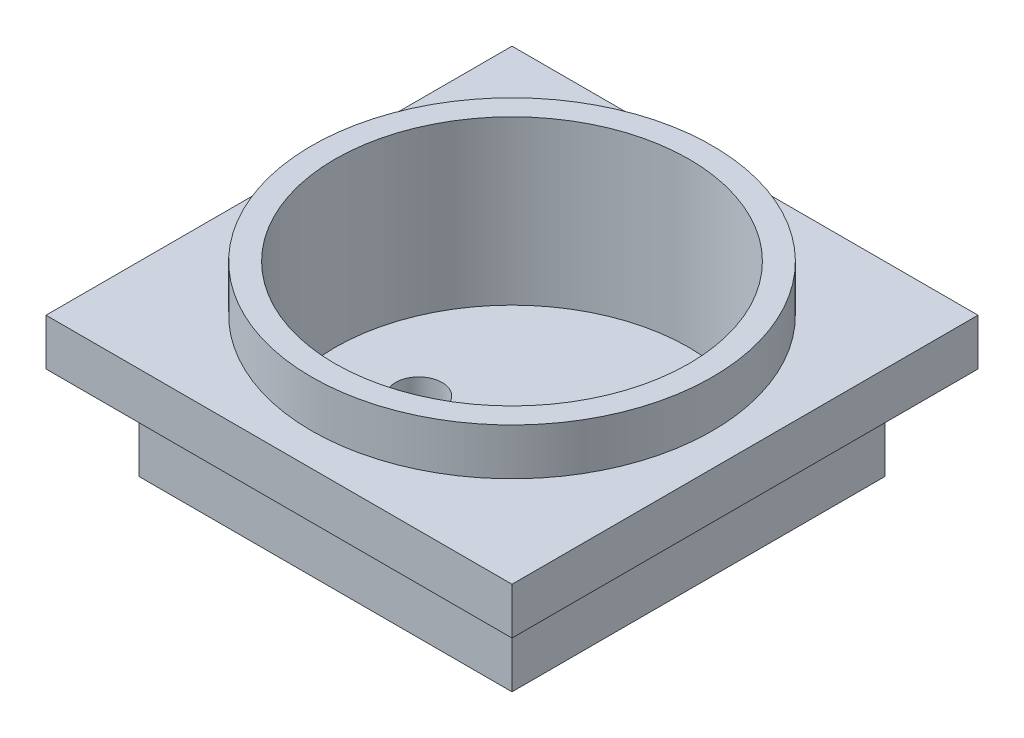
ISO-10303-21;
HEADER;
FILE_DESCRIPTION(('STEP AP214'),'2;1');
FILE_NAME('part.step','',(''),(''),'','','');
FILE_SCHEMA(('AUTOMOTIVE_DESIGN { 1 0 10303 214 1 1 1 1 }'));
ENDSEC;
DATA;
#1=APPLICATION_CONTEXT('core data for automotive mechanical design processes');
#2=APPLICATION_PROTOCOL_DEFINITION('international standard','automotive_design',2000,#1);
#3=PRODUCT_CONTEXT('',#1,'mechanical');
#4=PRODUCT('Part','Part','',(#3));
#5=PRODUCT_RELATED_PRODUCT_CATEGORY('part','',(#4));
#6=PRODUCT_DEFINITION_FORMATION('','',#4);
#7=PRODUCT_DEFINITION_CONTEXT('part definition',#1,'design');
#8=PRODUCT_DEFINITION('design','',#6,#7);
#9=PRODUCT_DEFINITION_SHAPE('','',#8);
#10=(LENGTH_UNIT() NAMED_UNIT(*) SI_UNIT(.MILLI.,.METRE.));
#11=(NAMED_UNIT(*) PLANE_ANGLE_UNIT() SI_UNIT($,.RADIAN.));
#12=(NAMED_UNIT(*) SI_UNIT($,.STERADIAN.) SOLID_ANGLE_UNIT());
#13=UNCERTAINTY_MEASURE_WITH_UNIT(LENGTH_MEASURE(1.E-05),#10,'distance_accuracy_value','');
#14=(GEOMETRIC_REPRESENTATION_CONTEXT(3) GLOBAL_UNCERTAINTY_ASSIGNED_CONTEXT((#13)) GLOBAL_UNIT_ASSIGNED_CONTEXT((#10,
#11,#12)) REPRESENTATION_CONTEXT('',''));
#15=CARTESIAN_POINT('',(0.,0.,0.));
#16=DIRECTION('',(0.,0.,1.));
#17=DIRECTION('',(1.,0.,0.));
#18=AXIS2_PLACEMENT_3D('',#15,#16,#17);
#19=CARTESIAN_POINT('',(0.,0.,0.));
#20=DIRECTION('',(0.,1.,0.));
#21=DIRECTION('',(0.,0.,1.));
#22=AXIS2_PLACEMENT_3D('',#19,#20,#21);
#23=PLANE('',#22);
#24=DIRECTION('',(0.,0.,-1.));
#25=VECTOR('',#24,1.);
#26=CARTESIAN_POINT('',(25.,0.,-25.));
#27=LINE('',#26,#25);
#28=CARTESIAN_POINT('',(25.,0.,25.));
#29=VERTEX_POINT('',#28);
#30=CARTESIAN_POINT('',(25.,0.,-25.));
#31=VERTEX_POINT('',#30);
#32=EDGE_CURVE('E146',#29,#31,#27,.T.);
#33=ORIENTED_EDGE('',*,*,#32,.F.);
#34=DIRECTION('',(1.,0.,0.));
#35=VECTOR('',#34,1.);
#36=CARTESIAN_POINT('',(-25.,0.,25.));
#37=LINE('',#36,#35);
#38=CARTESIAN_POINT('',(-25.,0.,25.));
#39=VERTEX_POINT('',#38);
#40=EDGE_CURVE('E157',#39,#29,#37,.T.);
#41=ORIENTED_EDGE('',*,*,#40,.F.);
#42=DIRECTION('',(0.,0.,1.));
#43=VECTOR('',#42,1.);
#44=CARTESIAN_POINT('',(-25.,0.,-25.));
#45=LINE('',#44,#43);
#46=CARTESIAN_POINT('',(-25.,0.,-25.));
#47=VERTEX_POINT('',#46);
#48=EDGE_CURVE('E170',#47,#39,#45,.T.);
#49=ORIENTED_EDGE('',*,*,#48,.F.);
#50=DIRECTION('',(-1.,0.,0.));
#51=VECTOR('',#50,1.);
#52=CARTESIAN_POINT('',(-25.,0.,-25.));
#53=LINE('',#52,#51);
#54=EDGE_CURVE('E168',#31,#47,#53,.T.);
#55=ORIENTED_EDGE('',*,*,#54,.F.);
#56=EDGE_LOOP('',(#33,#41,#49,#55));
#57=FACE_BOUND('',#56,.T.);
#58=DIRECTION('',(0.,0.,-1.));
#59=VECTOR('',#58,1.);
#60=CARTESIAN_POINT('',(-20.,0.,-20.));
#61=LINE('',#60,#59);
#62=CARTESIAN_POINT('',(-20.,0.,20.));
#63=VERTEX_POINT('',#62);
#64=CARTESIAN_POINT('',(-20.,0.,-20.));
#65=VERTEX_POINT('',#64);
#66=EDGE_CURVE('E58',#63,#65,#61,.T.);
#67=ORIENTED_EDGE('',*,*,#66,.F.);
#68=DIRECTION('',(-1.,0.,0.));
#69=VECTOR('',#68,1.);
#70=CARTESIAN_POINT('',(20.,0.,20.));
#71=LINE('',#70,#69);
#72=CARTESIAN_POINT('',(20.,0.,20.));
#73=VERTEX_POINT('',#72);
#74=EDGE_CURVE('E65',#73,#63,#71,.T.);
#75=ORIENTED_EDGE('',*,*,#74,.F.);
#76=DIRECTION('',(0.,0.,1.));
#77=VECTOR('',#76,1.);
#78=CARTESIAN_POINT('',(20.,0.,-20.));
#79=LINE('',#78,#77);
#80=CARTESIAN_POINT('',(20.,0.,-20.));
#81=VERTEX_POINT('',#80);
#82=EDGE_CURVE('E387',#81,#73,#79,.T.);
#83=ORIENTED_EDGE('',*,*,#82,.F.);
#84=DIRECTION('',(1.,0.,0.));
#85=VECTOR('',#84,1.);
#86=CARTESIAN_POINT('',(20.,0.,-20.));
#87=LINE('',#86,#85);
#88=EDGE_CURVE('E384',#65,#81,#87,.T.);
#89=ORIENTED_EDGE('',*,*,#88,.F.);
#90=EDGE_LOOP('',(#67,#75,#83,#89));
#91=FACE_BOUND('',#90,.T.);
#92=ADVANCED_FACE('F38',(#57,#91),#23,.F.);
#93=CARTESIAN_POINT('',(25.,5.,-25.));
#94=DIRECTION('',(-1.,0.,0.));
#95=DIRECTION('',(0.,0.,1.));
#96=AXIS2_PLACEMENT_3D('',#93,#94,#95);
#97=PLANE('',#96);
#98=ORIENTED_EDGE('',*,*,#32,.T.);
#99=DIRECTION('',(0.,-1.,0.));
#100=VECTOR('',#99,1.);
#101=CARTESIAN_POINT('',(25.,5.,-25.));
#102=LINE('',#101,#100);
#103=CARTESIAN_POINT('',(25.,5.,-25.));
#104=VERTEX_POINT('',#103);
#105=EDGE_CURVE('E42',#104,#31,#102,.T.);
#106=ORIENTED_EDGE('',*,*,#105,.F.);
#107=DIRECTION('',(0.,0.,-1.));
#108=VECTOR('',#107,1.);
#109=CARTESIAN_POINT('',(25.,5.,-25.));
#110=LINE('',#109,#108);
#111=CARTESIAN_POINT('',(25.,5.,25.));
#112=VERTEX_POINT('',#111);
#113=EDGE_CURVE('E152',#112,#104,#110,.T.);
#114=ORIENTED_EDGE('',*,*,#113,.F.);
#115=DIRECTION('',(0.,-1.,0.));
#116=VECTOR('',#115,1.);
#117=CARTESIAN_POINT('',(25.,5.,25.));
#118=LINE('',#117,#116);
#119=EDGE_CURVE('E164',#112,#29,#118,.T.);
#120=ORIENTED_EDGE('',*,*,#119,.T.);
#121=EDGE_LOOP('',(#98,#106,#114,#120));
#122=FACE_BOUND('',#121,.T.);
#123=ADVANCED_FACE('F40',(#122),#97,.F.);
#124=CARTESIAN_POINT('',(-25.,5.,-25.));
#125=DIRECTION('',(0.,0.,1.));
#126=DIRECTION('',(1.,0.,0.));
#127=AXIS2_PLACEMENT_3D('',#124,#125,#126);
#128=PLANE('',#127);
#129=ORIENTED_EDGE('',*,*,#54,.T.);
#130=DIRECTION('',(0.,-1.,0.));
#131=VECTOR('',#130,1.);
#132=CARTESIAN_POINT('',(-25.,5.,-25.));
#133=LINE('',#132,#131);
#134=CARTESIAN_POINT('',(-25.,5.,-25.));
#135=VERTEX_POINT('',#134);
#136=EDGE_CURVE('E181',#135,#47,#133,.T.);
#137=ORIENTED_EDGE('',*,*,#136,.F.);
#138=DIRECTION('',(-1.,0.,0.));
#139=VECTOR('',#138,1.);
#140=CARTESIAN_POINT('',(-25.,5.,-25.));
#141=LINE('',#140,#139);
#142=EDGE_CURVE('E156',#104,#135,#141,.T.);
#143=ORIENTED_EDGE('',*,*,#142,.F.);
#144=ORIENTED_EDGE('',*,*,#105,.T.);
#145=EDGE_LOOP('',(#129,#137,#143,#144));
#146=FACE_BOUND('',#145,.T.);
#147=ADVANCED_FACE('F190',(#146),#128,.F.);
#148=CARTESIAN_POINT('',(-25.,5.,-25.));
#149=DIRECTION('',(1.,0.,0.));
#150=DIRECTION('',(0.,0.,-1.));
#151=AXIS2_PLACEMENT_3D('',#148,#149,#150);
#152=PLANE('',#151);
#153=ORIENTED_EDGE('',*,*,#48,.T.);
#154=DIRECTION('',(0.,-1.,0.));
#155=VECTOR('',#154,1.);
#156=CARTESIAN_POINT('',(-25.,5.,25.));
#157=LINE('',#156,#155);
#158=CARTESIAN_POINT('',(-25.,5.,25.));
#159=VERTEX_POINT('',#158);
#160=EDGE_CURVE('E178',#159,#39,#157,.T.);
#161=ORIENTED_EDGE('',*,*,#160,.F.);
#162=DIRECTION('',(0.,0.,1.));
#163=VECTOR('',#162,1.);
#164=CARTESIAN_POINT('',(-25.,5.,-25.));
#165=LINE('',#164,#163);
#166=EDGE_CURVE('E159',#135,#159,#165,.T.);
#167=ORIENTED_EDGE('',*,*,#166,.F.);
#168=ORIENTED_EDGE('',*,*,#136,.T.);
#169=EDGE_LOOP('',(#153,#161,#167,#168));
#170=FACE_BOUND('',#169,.T.);
#171=ADVANCED_FACE('F198',(#170),#152,.F.);
#172=CARTESIAN_POINT('',(-25.,5.,25.));
#173=DIRECTION('',(0.,0.,-1.));
#174=DIRECTION('',(-1.,0.,0.));
#175=AXIS2_PLACEMENT_3D('',#172,#173,#174);
#176=PLANE('',#175);
#177=ORIENTED_EDGE('',*,*,#40,.T.);
#178=ORIENTED_EDGE('',*,*,#119,.F.);
#179=DIRECTION('',(1.,0.,0.));
#180=VECTOR('',#179,1.);
#181=CARTESIAN_POINT('',(-25.,5.,25.));
#182=LINE('',#181,#180);
#183=EDGE_CURVE('E161',#159,#112,#182,.T.);
#184=ORIENTED_EDGE('',*,*,#183,.F.);
#185=ORIENTED_EDGE('',*,*,#160,.T.);
#186=EDGE_LOOP('',(#177,#178,#184,#185));
#187=FACE_BOUND('',#186,.T.);
#188=ADVANCED_FACE('F201',(#187),#176,.F.);
#189=CARTESIAN_POINT('',(0.,5.,0.));
#190=DIRECTION('',(0.,1.,0.));
#191=DIRECTION('',(0.,0.,1.));
#192=AXIS2_PLACEMENT_3D('',#189,#190,#191);
#193=PLANE('',#192);
#194=CARTESIAN_POINT('',(0.,5.,0.));
#195=DIRECTION('',(0.,1.,0.));
#196=DIRECTION('',(0.,0.,1.));
#197=AXIS2_PLACEMENT_3D('',#194,#195,#196);
#198=CIRCLE('',#197,21.5);
#199=CARTESIAN_POINT('',(0.,5.,21.5));
#200=VERTEX_POINT('',#199);
#201=EDGE_CURVE('E11',#200,#200,#198,.T.);
#202=ORIENTED_EDGE('',*,*,#201,.F.);
#203=EDGE_LOOP('',(#202));
#204=FACE_BOUND('',#203,.T.);
#205=ORIENTED_EDGE('',*,*,#113,.T.);
#206=ORIENTED_EDGE('',*,*,#142,.T.);
#207=ORIENTED_EDGE('',*,*,#166,.T.);
#208=ORIENTED_EDGE('',*,*,#183,.T.);
#209=EDGE_LOOP('',(#205,#206,#207,#208));
#210=FACE_BOUND('',#209,.T.);
#211=ADVANCED_FACE('F203',(#204,#210),#193,.T.);
#212=CARTESIAN_POINT('',(0.,10.,0.));
#213=DIRECTION('',(0.,-1.,0.));
#214=DIRECTION('',(0.,0.,-1.));
#215=AXIS2_PLACEMENT_3D('',#212,#213,#214);
#216=CYLINDRICAL_SURFACE('',#215,21.5);
#217=CARTESIAN_POINT('',(0.,10.,0.));
#218=DIRECTION('',(0.,1.,0.));
#219=DIRECTION('',(0.,0.,1.));
#220=AXIS2_PLACEMENT_3D('',#217,#218,#219);
#221=CIRCLE('',#220,21.5);
#222=CARTESIAN_POINT('',(0.,10.,21.5));
#223=VERTEX_POINT('',#222);
#224=EDGE_CURVE('E140',#223,#223,#221,.T.);
#225=ORIENTED_EDGE('',*,*,#224,.F.);
#226=EDGE_LOOP('',(#225));
#227=FACE_BOUND('',#226,.T.);
#228=ORIENTED_EDGE('',*,*,#201,.T.);
#229=EDGE_LOOP('',(#228));
#230=FACE_BOUND('',#229,.T.);
#231=ADVANCED_FACE('F205',(#227,#230),#216,.T.);
#232=CARTESIAN_POINT('',(0.,10.,0.));
#233=DIRECTION('',(0.,1.,0.));
#234=DIRECTION('',(0.,0.,1.));
#235=AXIS2_PLACEMENT_3D('',#232,#233,#234);
#236=PLANE('',#235);
#237=CARTESIAN_POINT('',(0.,10.,0.));
#238=DIRECTION('',(0.,1.,0.));
#239=DIRECTION('',(0.,0.,1.));
#240=AXIS2_PLACEMENT_3D('',#237,#238,#239);
#241=CIRCLE('',#240,19.);
#242=CARTESIAN_POINT('',(0.,10.,19.));
#243=VERTEX_POINT('',#242);
#244=EDGE_CURVE('E361',#243,#243,#241,.T.);
#245=ORIENTED_EDGE('',*,*,#244,.F.);
#246=EDGE_LOOP('',(#245));
#247=FACE_BOUND('',#246,.T.);
#248=ORIENTED_EDGE('',*,*,#224,.T.);
#249=EDGE_LOOP('',(#248));
#250=FACE_BOUND('',#249,.T.);
#251=ADVANCED_FACE('F212',(#247,#250),#236,.T.);
#252=CARTESIAN_POINT('',(-20.,-10.,-20.));
#253=DIRECTION('',(1.,0.,0.));
#254=DIRECTION('',(0.,0.,-1.));
#255=AXIS2_PLACEMENT_3D('',#252,#253,#254);
#256=PLANE('',#255);
#257=ORIENTED_EDGE('',*,*,#66,.T.);
#258=DIRECTION('',(0.,1.,0.));
#259=VECTOR('',#258,1.);
#260=CARTESIAN_POINT('',(-20.,-10.,-20.));
#261=LINE('',#260,#259);
#262=CARTESIAN_POINT('',(-20.,-10.,-20.));
#263=VERTEX_POINT('',#262);
#264=EDGE_CURVE('E121',#263,#65,#261,.T.);
#265=ORIENTED_EDGE('',*,*,#264,.F.);
#266=DIRECTION('',(0.,0.,-1.));
#267=VECTOR('',#266,1.);
#268=CARTESIAN_POINT('',(-20.,-10.,-20.));
#269=LINE('',#268,#267);
#270=CARTESIAN_POINT('',(-20.,-10.,20.));
#271=VERTEX_POINT('',#270);
#272=EDGE_CURVE('E127',#271,#263,#269,.T.);
#273=ORIENTED_EDGE('',*,*,#272,.F.);
#274=DIRECTION('',(0.,1.,0.));
#275=VECTOR('',#274,1.);
#276=CARTESIAN_POINT('',(-20.,-10.,20.));
#277=LINE('',#276,#275);
#278=EDGE_CURVE('E381',#271,#63,#277,.T.);
#279=ORIENTED_EDGE('',*,*,#278,.T.);
#280=EDGE_LOOP('',(#257,#265,#273,#279));
#281=FACE_BOUND('',#280,.T.);
#282=ADVANCED_FACE('F138',(#281),#256,.F.);
#283=CARTESIAN_POINT('',(20.,-10.,-20.));
#284=DIRECTION('',(0.,0.,1.));
#285=DIRECTION('',(1.,0.,0.));
#286=AXIS2_PLACEMENT_3D('',#283,#284,#285);
#287=PLANE('',#286);
#288=ORIENTED_EDGE('',*,*,#88,.T.);
#289=DIRECTION('',(0.,1.,0.));
#290=VECTOR('',#289,1.);
#291=CARTESIAN_POINT('',(20.,-10.,-20.));
#292=LINE('',#291,#290);
#293=CARTESIAN_POINT('',(20.,-10.,-20.));
#294=VERTEX_POINT('',#293);
#295=EDGE_CURVE('E123',#294,#81,#292,.T.);
#296=ORIENTED_EDGE('',*,*,#295,.F.);
#297=DIRECTION('',(1.,0.,0.));
#298=VECTOR('',#297,1.);
#299=CARTESIAN_POINT('',(20.,-10.,-20.));
#300=LINE('',#299,#298);
#301=EDGE_CURVE('E116',#263,#294,#300,.T.);
#302=ORIENTED_EDGE('',*,*,#301,.F.);
#303=ORIENTED_EDGE('',*,*,#264,.T.);
#304=EDGE_LOOP('',(#288,#296,#302,#303));
#305=FACE_BOUND('',#304,.T.);
#306=ADVANCED_FACE('F119',(#305),#287,.F.);
#307=CARTESIAN_POINT('',(20.,-10.,-20.));
#308=DIRECTION('',(-1.,0.,0.));
#309=DIRECTION('',(0.,0.,1.));
#310=AXIS2_PLACEMENT_3D('',#307,#308,#309);
#311=PLANE('',#310);
#312=ORIENTED_EDGE('',*,*,#82,.T.);
#313=DIRECTION('',(0.,1.,0.));
#314=VECTOR('',#313,1.);
#315=CARTESIAN_POINT('',(20.,-10.,20.));
#316=LINE('',#315,#314);
#317=CARTESIAN_POINT('',(20.,-10.,20.));
#318=VERTEX_POINT('',#317);
#319=EDGE_CURVE('E148',#318,#73,#316,.T.);
#320=ORIENTED_EDGE('',*,*,#319,.F.);
#321=DIRECTION('',(0.,0.,1.));
#322=VECTOR('',#321,1.);
#323=CARTESIAN_POINT('',(20.,-10.,-20.));
#324=LINE('',#323,#322);
#325=EDGE_CURVE('E126',#294,#318,#324,.T.);
#326=ORIENTED_EDGE('',*,*,#325,.F.);
#327=ORIENTED_EDGE('',*,*,#295,.T.);
#328=EDGE_LOOP('',(#312,#320,#326,#327));
#329=FACE_BOUND('',#328,.T.);
#330=ADVANCED_FACE('F270',(#329),#311,.F.);
#331=CARTESIAN_POINT('',(20.,-10.,20.));
#332=DIRECTION('',(0.,0.,-1.));
#333=DIRECTION('',(-1.,0.,0.));
#334=AXIS2_PLACEMENT_3D('',#331,#332,#333);
#335=PLANE('',#334);
#336=ORIENTED_EDGE('',*,*,#74,.T.);
#337=ORIENTED_EDGE('',*,*,#278,.F.);
#338=DIRECTION('',(-1.,0.,0.));
#339=VECTOR('',#338,1.);
#340=CARTESIAN_POINT('',(20.,-10.,20.));
#341=LINE('',#340,#339);
#342=EDGE_CURVE('E132',#318,#271,#341,.T.);
#343=ORIENTED_EDGE('',*,*,#342,.F.);
#344=ORIENTED_EDGE('',*,*,#319,.T.);
#345=EDGE_LOOP('',(#336,#337,#343,#344));
#346=FACE_BOUND('',#345,.T.);
#347=ADVANCED_FACE('F279',(#346),#335,.F.);
#348=CARTESIAN_POINT('',(0.,-10.,0.));
#349=DIRECTION('',(0.,-1.,0.));
#350=DIRECTION('',(0.,0.,-1.));
#351=AXIS2_PLACEMENT_3D('',#348,#349,#350);
#352=PLANE('',#351);
#353=CARTESIAN_POINT('',(10.,-10.,0.));
#354=DIRECTION('',(0.,1.,0.));
#355=DIRECTION('',(0.,0.,1.));
#356=AXIS2_PLACEMENT_3D('',#353,#354,#355);
#357=CIRCLE('',#356,2.5);
#358=CARTESIAN_POINT('',(10.,-10.,2.5));
#359=VERTEX_POINT('',#358);
#360=EDGE_CURVE('E352',#359,#359,#357,.T.);
#361=ORIENTED_EDGE('',*,*,#360,.T.);
#362=EDGE_LOOP('',(#361));
#363=FACE_BOUND('',#362,.T.);
#364=CARTESIAN_POINT('',(-10.,-10.,0.));
#365=DIRECTION('',(0.,1.,0.));
#366=DIRECTION('',(0.,0.,-1.));
#367=AXIS2_PLACEMENT_3D('',#364,#365,#366);
#368=CIRCLE('',#367,2.5);
#369=CARTESIAN_POINT('',(-10.,-10.,-2.5));
#370=VERTEX_POINT('',#369);
#371=EDGE_CURVE('E357',#370,#370,#368,.T.);
#372=ORIENTED_EDGE('',*,*,#371,.T.);
#373=EDGE_LOOP('',(#372));
#374=FACE_BOUND('',#373,.T.);
#375=ORIENTED_EDGE('',*,*,#272,.T.);
#376=ORIENTED_EDGE('',*,*,#301,.T.);
#377=ORIENTED_EDGE('',*,*,#325,.T.);
#378=ORIENTED_EDGE('',*,*,#342,.T.);
#379=EDGE_LOOP('',(#375,#376,#377,#378));
#380=FACE_BOUND('',#379,.T.);
#381=ADVANCED_FACE('F130',(#363,#374,#380),#352,.T.);
#382=CARTESIAN_POINT('',(0.,-7.5,0.));
#383=DIRECTION('',(0.,1.,0.));
#384=DIRECTION('',(0.,0.,1.));
#385=AXIS2_PLACEMENT_3D('',#382,#383,#384);
#386=CYLINDRICAL_SURFACE('',#385,19.);
#387=CARTESIAN_POINT('',(0.,-7.5,0.));
#388=DIRECTION('',(0.,1.,0.));
#389=DIRECTION('',(0.,0.,1.));
#390=AXIS2_PLACEMENT_3D('',#387,#388,#389);
#391=CIRCLE('',#390,19.);
#392=CARTESIAN_POINT('',(0.,-7.5,19.));
#393=VERTEX_POINT('',#392);
#394=EDGE_CURVE('E371',#393,#393,#391,.T.);
#395=ORIENTED_EDGE('',*,*,#394,.F.);
#396=EDGE_LOOP('',(#395));
#397=FACE_BOUND('',#396,.T.);
#398=ORIENTED_EDGE('',*,*,#244,.T.);
#399=EDGE_LOOP('',(#398));
#400=FACE_BOUND('',#399,.T.);
#401=ADVANCED_FACE('F303',(#397,#400),#386,.F.);
#402=CARTESIAN_POINT('',(0.,-7.5,0.));
#403=DIRECTION('',(0.,1.,0.));
#404=DIRECTION('',(0.,0.,1.));
#405=AXIS2_PLACEMENT_3D('',#402,#403,#404);
#406=PLANE('',#405);
#407=CARTESIAN_POINT('',(10.,-7.5,0.));
#408=DIRECTION('',(0.,1.,0.));
#409=DIRECTION('',(0.,0.,1.));
#410=AXIS2_PLACEMENT_3D('',#407,#408,#409);
#411=CIRCLE('',#410,2.5);
#412=CARTESIAN_POINT('',(10.,-7.5,2.5));
#413=VERTEX_POINT('',#412);
#414=EDGE_CURVE('E355',#413,#413,#411,.T.);
#415=ORIENTED_EDGE('',*,*,#414,.F.);
#416=EDGE_LOOP('',(#415));
#417=FACE_BOUND('',#416,.T.);
#418=CARTESIAN_POINT('',(-10.,-7.5,0.));
#419=DIRECTION('',(0.,1.,0.));
#420=DIRECTION('',(0.,0.,-1.));
#421=AXIS2_PLACEMENT_3D('',#418,#419,#420);
#422=CIRCLE('',#421,2.5);
#423=CARTESIAN_POINT('',(-10.,-7.5,-2.5));
#424=VERTEX_POINT('',#423);
#425=EDGE_CURVE('E365',#424,#424,#422,.T.);
#426=ORIENTED_EDGE('',*,*,#425,.F.);
#427=EDGE_LOOP('',(#426));
#428=FACE_BOUND('',#427,.T.);
#429=ORIENTED_EDGE('',*,*,#394,.T.);
#430=EDGE_LOOP('',(#429));
#431=FACE_BOUND('',#430,.T.);
#432=ADVANCED_FACE('F308',(#417,#428,#431),#406,.T.);
#433=CARTESIAN_POINT('',(-10.,-10.,0.));
#434=DIRECTION('',(0.,1.,0.));
#435=DIRECTION('',(0.,0.,1.));
#436=AXIS2_PLACEMENT_3D('',#433,#434,#435);
#437=CYLINDRICAL_SURFACE('',#436,2.5);
#438=ORIENTED_EDGE('',*,*,#371,.F.);
#439=EDGE_LOOP('',(#438));
#440=FACE_BOUND('',#439,.T.);
#441=ORIENTED_EDGE('',*,*,#425,.T.);
#442=EDGE_LOOP('',(#441));
#443=FACE_BOUND('',#442,.T.);
#444=ADVANCED_FACE('F325',(#440,#443),#437,.F.);
#445=CARTESIAN_POINT('',(10.,-10.,0.));
#446=DIRECTION('',(0.,1.,0.));
#447=DIRECTION('',(0.,0.,1.));
#448=AXIS2_PLACEMENT_3D('',#445,#446,#447);
#449=CYLINDRICAL_SURFACE('',#448,2.5);
#450=ORIENTED_EDGE('',*,*,#360,.F.);
#451=EDGE_LOOP('',(#450));
#452=FACE_BOUND('',#451,.T.);
#453=ORIENTED_EDGE('',*,*,#414,.T.);
#454=EDGE_LOOP('',(#453));
#455=FACE_BOUND('',#454,.T.);
#456=ADVANCED_FACE('F335',(#452,#455),#449,.F.);
#457=CLOSED_SHELL('',(#92,#123,#147,#171,#188,#211,#231,#251,#282,#306,#330,#347,#381,#401,#432,
#444,#456));
#458=MANIFOLD_SOLID_BREP('B2',#457);
#459=ADVANCED_BREP_SHAPE_REPRESENTATION('',(#18,#458),#14);
#460=SHAPE_DEFINITION_REPRESENTATION(#9,#459);
ENDSEC;
END-ISO-10303-21;
